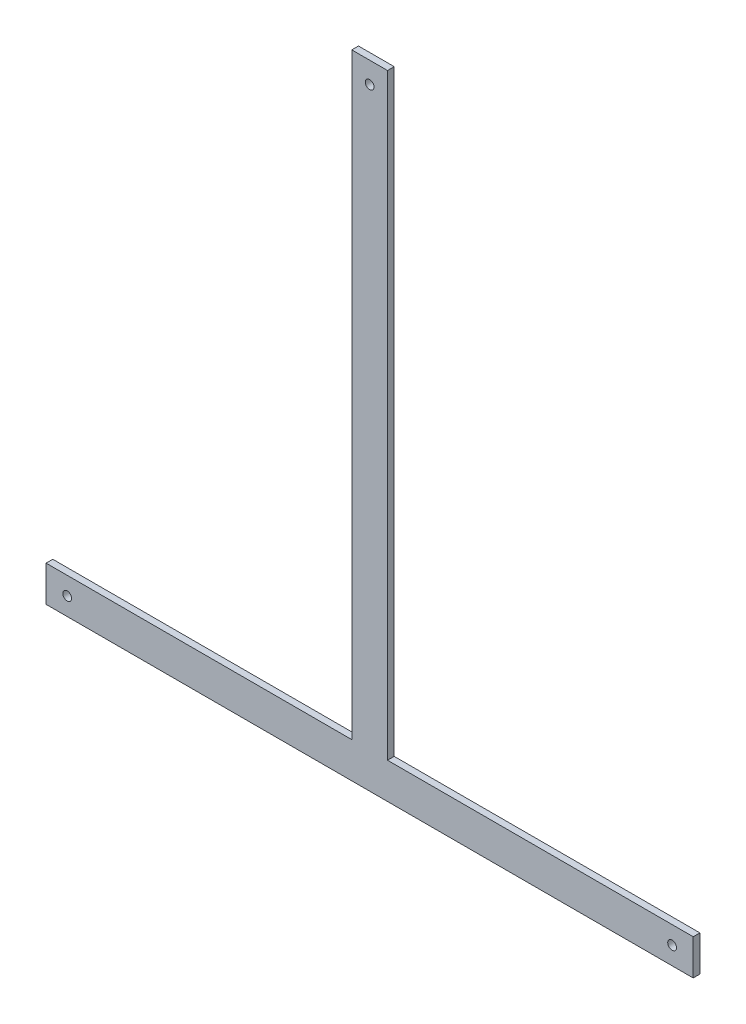
ISO-10303-21;
HEADER;
FILE_DESCRIPTION(('STEP AP214'),'2;1');
FILE_NAME('part.step','',(''),(''),'','','');
FILE_SCHEMA(('AUTOMOTIVE_DESIGN { 1 0 10303 214 1 1 1 1 }'));
ENDSEC;
DATA;
#1=APPLICATION_CONTEXT('core data for automotive mechanical design processes');
#2=APPLICATION_PROTOCOL_DEFINITION('international standard','automotive_design',2000,#1);
#3=PRODUCT_CONTEXT('',#1,'mechanical');
#4=PRODUCT('Part','Part','',(#3));
#5=PRODUCT_RELATED_PRODUCT_CATEGORY('part','',(#4));
#6=PRODUCT_DEFINITION_FORMATION('','',#4);
#7=PRODUCT_DEFINITION_CONTEXT('part definition',#1,'design');
#8=PRODUCT_DEFINITION('design','',#6,#7);
#9=PRODUCT_DEFINITION_SHAPE('','',#8);
#10=(LENGTH_UNIT() NAMED_UNIT(*) SI_UNIT(.MILLI.,.METRE.));
#11=(NAMED_UNIT(*) PLANE_ANGLE_UNIT() SI_UNIT($,.RADIAN.));
#12=(NAMED_UNIT(*) SI_UNIT($,.STERADIAN.) SOLID_ANGLE_UNIT());
#13=UNCERTAINTY_MEASURE_WITH_UNIT(LENGTH_MEASURE(1.E-05),#10,'distance_accuracy_value','');
#14=(GEOMETRIC_REPRESENTATION_CONTEXT(3) GLOBAL_UNCERTAINTY_ASSIGNED_CONTEXT((#13)) GLOBAL_UNIT_ASSIGNED_CONTEXT((#10,
#11,#12)) REPRESENTATION_CONTEXT('',''));
#15=CARTESIAN_POINT('',(0.,0.,0.));
#16=DIRECTION('',(0.,0.,1.));
#17=DIRECTION('',(1.,0.,0.));
#18=AXIS2_PLACEMENT_3D('',#15,#16,#17);
#19=CARTESIAN_POINT('',(230.,0.,4.7625));
#20=DIRECTION('',(-1.,0.,0.));
#21=DIRECTION('',(0.,0.,1.));
#22=AXIS2_PLACEMENT_3D('',#19,#20,#21);
#23=PLANE('',#22);
#24=DIRECTION('',(0.,1.,0.));
#25=VECTOR('',#24,1.);
#26=CARTESIAN_POINT('',(230.,0.,0.));
#27=LINE('',#26,#25);
#28=CARTESIAN_POINT('',(230.,0.,0.));
#29=VERTEX_POINT('',#28);
#30=CARTESIAN_POINT('',(230.,25.4,0.));
#31=VERTEX_POINT('',#30);
#32=EDGE_CURVE('E131',#29,#31,#27,.T.);
#33=ORIENTED_EDGE('',*,*,#32,.T.);
#34=DIRECTION('',(0.,0.,-1.));
#35=VECTOR('',#34,1.);
#36=CARTESIAN_POINT('',(230.,25.4,4.7625));
#37=LINE('',#36,#35);
#38=CARTESIAN_POINT('',(230.,25.4,4.7625));
#39=VERTEX_POINT('',#38);
#40=EDGE_CURVE('E11',#39,#31,#37,.T.);
#41=ORIENTED_EDGE('',*,*,#40,.F.);
#42=DIRECTION('',(0.,1.,0.));
#43=VECTOR('',#42,1.);
#44=CARTESIAN_POINT('',(230.,0.,4.7625));
#45=LINE('',#44,#43);
#46=CARTESIAN_POINT('',(230.,0.,4.7625));
#47=VERTEX_POINT('',#46);
#48=EDGE_CURVE('E146',#47,#39,#45,.T.);
#49=ORIENTED_EDGE('',*,*,#48,.F.);
#50=DIRECTION('',(0.,0.,-1.));
#51=VECTOR('',#50,1.);
#52=CARTESIAN_POINT('',(230.,0.,4.7625));
#53=LINE('',#52,#51);
#54=EDGE_CURVE('E127',#47,#29,#53,.T.);
#55=ORIENTED_EDGE('',*,*,#54,.T.);
#56=EDGE_LOOP('',(#33,#41,#49,#55));
#57=FACE_BOUND('',#56,.T.);
#58=ADVANCED_FACE('F35',(#57),#23,.F.);
#59=CARTESIAN_POINT('',(230.,25.4,4.7625));
#60=DIRECTION('',(0.,-1.,0.));
#61=DIRECTION('',(1.,0.,0.));
#62=AXIS2_PLACEMENT_3D('',#59,#60,#61);
#63=PLANE('',#62);
#64=DIRECTION('',(-1.,0.,0.));
#65=VECTOR('',#64,1.);
#66=CARTESIAN_POINT('',(230.,25.4,0.));
#67=LINE('',#66,#65);
#68=CARTESIAN_POINT('',(12.7,25.4,0.));
#69=VERTEX_POINT('',#68);
#70=EDGE_CURVE('E134',#31,#69,#67,.T.);
#71=ORIENTED_EDGE('',*,*,#70,.T.);
#72=DIRECTION('',(0.,0.,-1.));
#73=VECTOR('',#72,1.);
#74=CARTESIAN_POINT('',(12.7,25.4,4.7625));
#75=LINE('',#74,#73);
#76=CARTESIAN_POINT('',(12.7,25.4,4.7625));
#77=VERTEX_POINT('',#76);
#78=EDGE_CURVE('E43',#77,#69,#75,.T.);
#79=ORIENTED_EDGE('',*,*,#78,.F.);
#80=DIRECTION('',(-1.,0.,0.));
#81=VECTOR('',#80,1.);
#82=CARTESIAN_POINT('',(230.,25.4,4.7625));
#83=LINE('',#82,#81);
#84=EDGE_CURVE('E94',#39,#77,#83,.T.);
#85=ORIENTED_EDGE('',*,*,#84,.F.);
#86=ORIENTED_EDGE('',*,*,#40,.T.);
#87=EDGE_LOOP('',(#71,#79,#85,#86));
#88=FACE_BOUND('',#87,.T.);
#89=ADVANCED_FACE('F227',(#88),#63,.F.);
#90=CARTESIAN_POINT('',(12.7,25.4,4.7625));
#91=DIRECTION('',(-1.,0.,0.));
#92=DIRECTION('',(0.,0.,1.));
#93=AXIS2_PLACEMENT_3D('',#90,#91,#92);
#94=PLANE('',#93);
#95=DIRECTION('',(0.,1.,0.));
#96=VECTOR('',#95,1.);
#97=CARTESIAN_POINT('',(12.7,25.4,0.));
#98=LINE('',#97,#96);
#99=CARTESIAN_POINT('',(12.7,450.,0.));
#100=VERTEX_POINT('',#99);
#101=EDGE_CURVE('E137',#69,#100,#98,.T.);
#102=ORIENTED_EDGE('',*,*,#101,.T.);
#103=DIRECTION('',(0.,0.,-1.));
#104=VECTOR('',#103,1.);
#105=CARTESIAN_POINT('',(12.7,450.,4.7625));
#106=LINE('',#105,#104);
#107=CARTESIAN_POINT('',(12.7,450.,4.7625));
#108=VERTEX_POINT('',#107);
#109=EDGE_CURVE('E153',#108,#100,#106,.T.);
#110=ORIENTED_EDGE('',*,*,#109,.F.);
#111=DIRECTION('',(0.,1.,0.));
#112=VECTOR('',#111,1.);
#113=CARTESIAN_POINT('',(12.7,25.4,4.7625));
#114=LINE('',#113,#112);
#115=EDGE_CURVE('E161',#77,#108,#114,.T.);
#116=ORIENTED_EDGE('',*,*,#115,.F.);
#117=ORIENTED_EDGE('',*,*,#78,.T.);
#118=EDGE_LOOP('',(#102,#110,#116,#117));
#119=FACE_BOUND('',#118,.T.);
#120=ADVANCED_FACE('F159',(#119),#94,.F.);
#121=CARTESIAN_POINT('',(12.7,450.,4.7625));
#122=DIRECTION('',(0.,-1.,0.));
#123=DIRECTION('',(0.,0.,-1.));
#124=AXIS2_PLACEMENT_3D('',#121,#122,#123);
#125=PLANE('',#124);
#126=DIRECTION('',(-1.,0.,0.));
#127=VECTOR('',#126,1.);
#128=CARTESIAN_POINT('',(12.7,450.,0.));
#129=LINE('',#128,#127);
#130=CARTESIAN_POINT('',(-12.7,450.,0.));
#131=VERTEX_POINT('',#130);
#132=EDGE_CURVE('E139',#100,#131,#129,.T.);
#133=ORIENTED_EDGE('',*,*,#132,.T.);
#134=DIRECTION('',(0.,0.,-1.));
#135=VECTOR('',#134,1.);
#136=CARTESIAN_POINT('',(-12.7,450.,4.7625));
#137=LINE('',#136,#135);
#138=CARTESIAN_POINT('',(-12.7,450.,4.7625));
#139=VERTEX_POINT('',#138);
#140=EDGE_CURVE('E150',#139,#131,#137,.T.);
#141=ORIENTED_EDGE('',*,*,#140,.F.);
#142=DIRECTION('',(-1.,0.,0.));
#143=VECTOR('',#142,1.);
#144=CARTESIAN_POINT('',(12.7,450.,4.7625));
#145=LINE('',#144,#143);
#146=EDGE_CURVE('E173',#108,#139,#145,.T.);
#147=ORIENTED_EDGE('',*,*,#146,.F.);
#148=ORIENTED_EDGE('',*,*,#109,.T.);
#149=EDGE_LOOP('',(#133,#141,#147,#148));
#150=FACE_BOUND('',#149,.T.);
#151=ADVANCED_FACE('F169',(#150),#125,.F.);
#152=CARTESIAN_POINT('',(-12.7,25.4,4.7625));
#153=DIRECTION('',(1.,0.,0.));
#154=DIRECTION('',(0.,0.,-1.));
#155=AXIS2_PLACEMENT_3D('',#152,#153,#154);
#156=PLANE('',#155);
#157=DIRECTION('',(0.,-1.,0.));
#158=VECTOR('',#157,1.);
#159=CARTESIAN_POINT('',(-12.7,25.4,0.));
#160=LINE('',#159,#158);
#161=CARTESIAN_POINT('',(-12.7,25.4,0.));
#162=VERTEX_POINT('',#161);
#163=EDGE_CURVE('E141',#131,#162,#160,.T.);
#164=ORIENTED_EDGE('',*,*,#163,.T.);
#165=DIRECTION('',(0.,0.,-1.));
#166=VECTOR('',#165,1.);
#167=CARTESIAN_POINT('',(-12.7,25.4,4.7625));
#168=LINE('',#167,#166);
#169=CARTESIAN_POINT('',(-12.7,25.4,4.7625));
#170=VERTEX_POINT('',#169);
#171=EDGE_CURVE('E122',#170,#162,#168,.T.);
#172=ORIENTED_EDGE('',*,*,#171,.F.);
#173=DIRECTION('',(0.,-1.,0.));
#174=VECTOR('',#173,1.);
#175=CARTESIAN_POINT('',(-12.7,25.4,4.7625));
#176=LINE('',#175,#174);
#177=EDGE_CURVE('E113',#139,#170,#176,.T.);
#178=ORIENTED_EDGE('',*,*,#177,.F.);
#179=ORIENTED_EDGE('',*,*,#140,.T.);
#180=EDGE_LOOP('',(#164,#172,#178,#179));
#181=FACE_BOUND('',#180,.T.);
#182=ADVANCED_FACE('F172',(#181),#156,.F.);
#183=CARTESIAN_POINT('',(-230.,25.4,4.7625));
#184=DIRECTION('',(0.,-1.,0.));
#185=DIRECTION('',(1.,0.,0.));
#186=AXIS2_PLACEMENT_3D('',#183,#184,#185);
#187=PLANE('',#186);
#188=DIRECTION('',(-1.,0.,0.));
#189=VECTOR('',#188,1.);
#190=CARTESIAN_POINT('',(-230.,25.4,0.));
#191=LINE('',#190,#189);
#192=CARTESIAN_POINT('',(-230.,25.4,0.));
#193=VERTEX_POINT('',#192);
#194=EDGE_CURVE('E121',#162,#193,#191,.T.);
#195=ORIENTED_EDGE('',*,*,#194,.T.);
#196=DIRECTION('',(0.,0.,-1.));
#197=VECTOR('',#196,1.);
#198=CARTESIAN_POINT('',(-230.,25.4,4.7625));
#199=LINE('',#198,#197);
#200=CARTESIAN_POINT('',(-230.,25.4,4.7625));
#201=VERTEX_POINT('',#200);
#202=EDGE_CURVE('E118',#201,#193,#199,.T.);
#203=ORIENTED_EDGE('',*,*,#202,.F.);
#204=DIRECTION('',(-1.,0.,0.));
#205=VECTOR('',#204,1.);
#206=CARTESIAN_POINT('',(-230.,25.4,4.7625));
#207=LINE('',#206,#205);
#208=EDGE_CURVE('E107',#170,#201,#207,.T.);
#209=ORIENTED_EDGE('',*,*,#208,.F.);
#210=ORIENTED_EDGE('',*,*,#171,.T.);
#211=EDGE_LOOP('',(#195,#203,#209,#210));
#212=FACE_BOUND('',#211,.T.);
#213=ADVANCED_FACE('F119',(#212),#187,.F.);
#214=CARTESIAN_POINT('',(-230.,0.,4.7625));
#215=DIRECTION('',(1.,0.,0.));
#216=DIRECTION('',(0.,0.,-1.));
#217=AXIS2_PLACEMENT_3D('',#214,#215,#216);
#218=PLANE('',#217);
#219=DIRECTION('',(0.,-1.,0.));
#220=VECTOR('',#219,1.);
#221=CARTESIAN_POINT('',(-230.,0.,0.));
#222=LINE('',#221,#220);
#223=CARTESIAN_POINT('',(-230.,0.,0.));
#224=VERTEX_POINT('',#223);
#225=EDGE_CURVE('E80',#193,#224,#222,.T.);
#226=ORIENTED_EDGE('',*,*,#225,.T.);
#227=DIRECTION('',(0.,0.,-1.));
#228=VECTOR('',#227,1.);
#229=CARTESIAN_POINT('',(-230.,0.,4.7625));
#230=LINE('',#229,#228);
#231=CARTESIAN_POINT('',(-230.,0.,4.7625));
#232=VERTEX_POINT('',#231);
#233=EDGE_CURVE('E123',#232,#224,#230,.T.);
#234=ORIENTED_EDGE('',*,*,#233,.F.);
#235=DIRECTION('',(0.,-1.,0.));
#236=VECTOR('',#235,1.);
#237=CARTESIAN_POINT('',(-230.,0.,4.7625));
#238=LINE('',#237,#236);
#239=EDGE_CURVE('E111',#201,#232,#238,.T.);
#240=ORIENTED_EDGE('',*,*,#239,.F.);
#241=ORIENTED_EDGE('',*,*,#202,.T.);
#242=EDGE_LOOP('',(#226,#234,#240,#241));
#243=FACE_BOUND('',#242,.T.);
#244=ADVANCED_FACE('F125',(#243),#218,.F.);
#245=CARTESIAN_POINT('',(-230.,0.,4.7625));
#246=DIRECTION('',(0.,1.,0.));
#247=DIRECTION('',(0.,0.,1.));
#248=AXIS2_PLACEMENT_3D('',#245,#246,#247);
#249=PLANE('',#248);
#250=DIRECTION('',(1.,0.,0.));
#251=VECTOR('',#250,1.);
#252=CARTESIAN_POINT('',(-230.,0.,0.));
#253=LINE('',#252,#251);
#254=EDGE_CURVE('E86',#224,#29,#253,.T.);
#255=ORIENTED_EDGE('',*,*,#254,.T.);
#256=ORIENTED_EDGE('',*,*,#54,.F.);
#257=DIRECTION('',(1.,0.,0.));
#258=VECTOR('',#257,1.);
#259=CARTESIAN_POINT('',(-230.,0.,4.7625));
#260=LINE('',#259,#258);
#261=EDGE_CURVE('E51',#232,#47,#260,.T.);
#262=ORIENTED_EDGE('',*,*,#261,.F.);
#263=ORIENTED_EDGE('',*,*,#233,.T.);
#264=EDGE_LOOP('',(#255,#256,#262,#263));
#265=FACE_BOUND('',#264,.T.);
#266=ADVANCED_FACE('F208',(#265),#249,.F.);
#267=CARTESIAN_POINT('',(230.,450.,4.7625));
#268=DIRECTION('',(0.,0.,1.));
#269=DIRECTION('',(1.,0.,0.));
#270=AXIS2_PLACEMENT_3D('',#267,#268,#269);
#271=PLANE('',#270);
#272=CARTESIAN_POINT('',(0.,435.,4.7625));
#273=DIRECTION('',(0.,0.,1.));
#274=DIRECTION('',(1.,0.,0.));
#275=AXIS2_PLACEMENT_3D('',#272,#273,#274);
#276=CIRCLE('',#275,3.12499999999999);
#277=CARTESIAN_POINT('',(3.12499999999999,435.,4.7625));
#278=VERTEX_POINT('',#277);
#279=EDGE_CURVE('E191',#278,#278,#276,.T.);
#280=ORIENTED_EDGE('',*,*,#279,.F.);
#281=EDGE_LOOP('',(#280));
#282=FACE_BOUND('',#281,.T.);
#283=CARTESIAN_POINT('',(-215.,12.7,4.7625));
#284=DIRECTION('',(0.,0.,1.));
#285=DIRECTION('',(1.,0.,0.));
#286=AXIS2_PLACEMENT_3D('',#283,#284,#285);
#287=CIRCLE('',#286,3.125);
#288=CARTESIAN_POINT('',(-211.875,12.7,4.7625));
#289=VERTEX_POINT('',#288);
#290=EDGE_CURVE('E185',#289,#289,#287,.T.);
#291=ORIENTED_EDGE('',*,*,#290,.F.);
#292=EDGE_LOOP('',(#291));
#293=FACE_BOUND('',#292,.T.);
#294=CARTESIAN_POINT('',(215.,12.7,4.7625));
#295=DIRECTION('',(0.,0.,1.));
#296=DIRECTION('',(1.,0.,0.));
#297=AXIS2_PLACEMENT_3D('',#294,#295,#296);
#298=CIRCLE('',#297,3.125);
#299=CARTESIAN_POINT('',(218.125,12.7,4.7625));
#300=VERTEX_POINT('',#299);
#301=EDGE_CURVE('E179',#300,#300,#298,.T.);
#302=ORIENTED_EDGE('',*,*,#301,.F.);
#303=EDGE_LOOP('',(#302));
#304=FACE_BOUND('',#303,.T.);
#305=ORIENTED_EDGE('',*,*,#48,.T.);
#306=ORIENTED_EDGE('',*,*,#84,.T.);
#307=ORIENTED_EDGE('',*,*,#115,.T.);
#308=ORIENTED_EDGE('',*,*,#146,.T.);
#309=ORIENTED_EDGE('',*,*,#177,.T.);
#310=ORIENTED_EDGE('',*,*,#208,.T.);
#311=ORIENTED_EDGE('',*,*,#239,.T.);
#312=ORIENTED_EDGE('',*,*,#261,.T.);
#313=EDGE_LOOP('',(#305,#306,#307,#308,#309,#310,#311,#312));
#314=FACE_BOUND('',#313,.T.);
#315=ADVANCED_FACE('F109',(#282,#293,#304,#314),#271,.T.);
#316=CARTESIAN_POINT('',(230.,450.,0.));
#317=DIRECTION('',(0.,0.,1.));
#318=DIRECTION('',(1.,0.,0.));
#319=AXIS2_PLACEMENT_3D('',#316,#317,#318);
#320=PLANE('',#319);
#321=CARTESIAN_POINT('',(0.,435.,0.));
#322=DIRECTION('',(0.,0.,1.));
#323=DIRECTION('',(1.,0.,0.));
#324=AXIS2_PLACEMENT_3D('',#321,#322,#323);
#325=CIRCLE('',#324,3.12499999999999);
#326=CARTESIAN_POINT('',(3.12499999999999,435.,0.));
#327=VERTEX_POINT('',#326);
#328=EDGE_CURVE('E188',#327,#327,#325,.T.);
#329=ORIENTED_EDGE('',*,*,#328,.T.);
#330=EDGE_LOOP('',(#329));
#331=FACE_BOUND('',#330,.T.);
#332=CARTESIAN_POINT('',(-215.,12.7,0.));
#333=DIRECTION('',(0.,0.,1.));
#334=DIRECTION('',(1.,0.,0.));
#335=AXIS2_PLACEMENT_3D('',#332,#333,#334);
#336=CIRCLE('',#335,3.125);
#337=CARTESIAN_POINT('',(-211.875,12.7,0.));
#338=VERTEX_POINT('',#337);
#339=EDGE_CURVE('E182',#338,#338,#336,.T.);
#340=ORIENTED_EDGE('',*,*,#339,.T.);
#341=EDGE_LOOP('',(#340));
#342=FACE_BOUND('',#341,.T.);
#343=CARTESIAN_POINT('',(215.,12.7,0.));
#344=DIRECTION('',(0.,0.,1.));
#345=DIRECTION('',(1.,0.,0.));
#346=AXIS2_PLACEMENT_3D('',#343,#344,#345);
#347=CIRCLE('',#346,3.125);
#348=CARTESIAN_POINT('',(218.125,12.7,0.));
#349=VERTEX_POINT('',#348);
#350=EDGE_CURVE('E135',#349,#349,#347,.T.);
#351=ORIENTED_EDGE('',*,*,#350,.T.);
#352=EDGE_LOOP('',(#351));
#353=FACE_BOUND('',#352,.T.);
#354=ORIENTED_EDGE('',*,*,#32,.F.);
#355=ORIENTED_EDGE('',*,*,#254,.F.);
#356=ORIENTED_EDGE('',*,*,#225,.F.);
#357=ORIENTED_EDGE('',*,*,#194,.F.);
#358=ORIENTED_EDGE('',*,*,#163,.F.);
#359=ORIENTED_EDGE('',*,*,#132,.F.);
#360=ORIENTED_EDGE('',*,*,#101,.F.);
#361=ORIENTED_EDGE('',*,*,#70,.F.);
#362=EDGE_LOOP('',(#354,#355,#356,#357,#358,#359,#360,#361));
#363=FACE_BOUND('',#362,.T.);
#364=ADVANCED_FACE('F165',(#331,#342,#353,#363),#320,.F.);
#365=CARTESIAN_POINT('',(215.,12.7,0.));
#366=DIRECTION('',(0.,0.,1.));
#367=DIRECTION('',(1.,0.,0.));
#368=AXIS2_PLACEMENT_3D('',#365,#366,#367);
#369=CYLINDRICAL_SURFACE('',#368,3.125);
#370=ORIENTED_EDGE('',*,*,#350,.F.);
#371=EDGE_LOOP('',(#370));
#372=FACE_BOUND('',#371,.T.);
#373=ORIENTED_EDGE('',*,*,#301,.T.);
#374=EDGE_LOOP('',(#373));
#375=FACE_BOUND('',#374,.T.);
#376=ADVANCED_FACE('F214',(#372,#375),#369,.F.);
#377=CARTESIAN_POINT('',(-215.,12.7,0.));
#378=DIRECTION('',(0.,0.,1.));
#379=DIRECTION('',(1.,0.,0.));
#380=AXIS2_PLACEMENT_3D('',#377,#378,#379);
#381=CYLINDRICAL_SURFACE('',#380,3.125);
#382=ORIENTED_EDGE('',*,*,#339,.F.);
#383=EDGE_LOOP('',(#382));
#384=FACE_BOUND('',#383,.T.);
#385=ORIENTED_EDGE('',*,*,#290,.T.);
#386=EDGE_LOOP('',(#385));
#387=FACE_BOUND('',#386,.T.);
#388=ADVANCED_FACE('F202',(#384,#387),#381,.F.);
#389=CARTESIAN_POINT('',(0.,435.,0.));
#390=DIRECTION('',(0.,0.,1.));
#391=DIRECTION('',(1.,0.,0.));
#392=AXIS2_PLACEMENT_3D('',#389,#390,#391);
#393=CYLINDRICAL_SURFACE('',#392,3.12499999999999);
#394=ORIENTED_EDGE('',*,*,#328,.F.);
#395=EDGE_LOOP('',(#394));
#396=FACE_BOUND('',#395,.T.);
#397=ORIENTED_EDGE('',*,*,#279,.T.);
#398=EDGE_LOOP('',(#397));
#399=FACE_BOUND('',#398,.T.);
#400=ADVANCED_FACE('F199',(#396,#399),#393,.F.);
#401=CLOSED_SHELL('',(#58,#89,#120,#151,#182,#213,#244,#266,#315,#364,#376,#388,#400));
#402=MANIFOLD_SOLID_BREP('B2',#401);
#403=ADVANCED_BREP_SHAPE_REPRESENTATION('',(#18,#402),#14);
#404=SHAPE_DEFINITION_REPRESENTATION(#9,#403);
ENDSEC;
END-ISO-10303-21;
